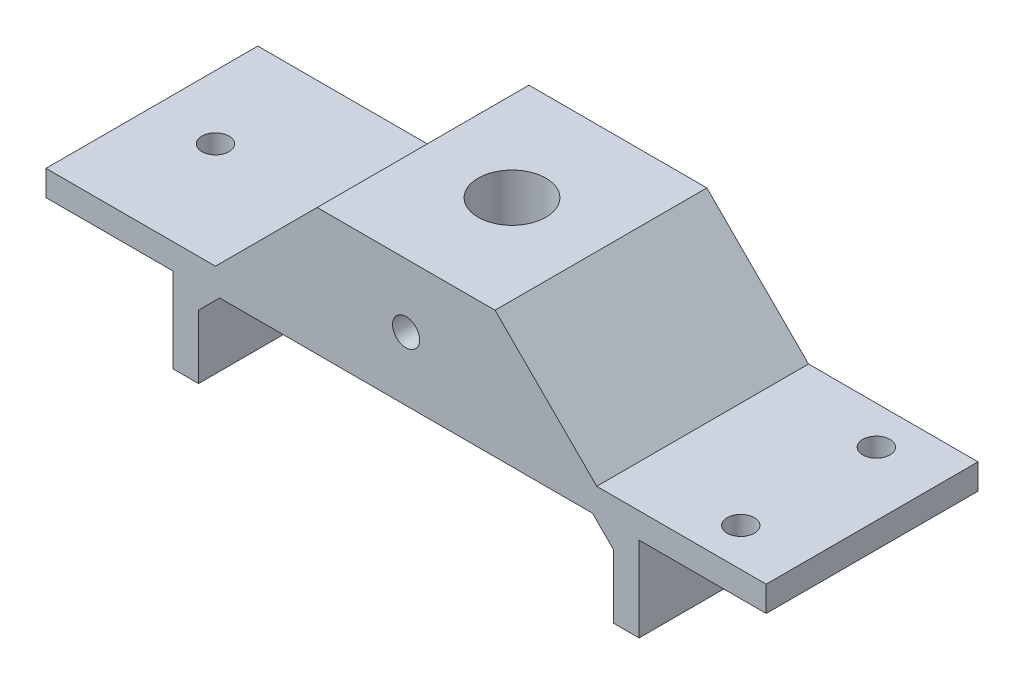
ISO-10303-21;
HEADER;
FILE_DESCRIPTION(('STEP AP214'),'2;1');
FILE_NAME('part.step','',(''),(''),'','','');
FILE_SCHEMA(('AUTOMOTIVE_DESIGN { 1 0 10303 214 1 1 1 1 }'));
ENDSEC;
DATA;
#1=APPLICATION_CONTEXT('core data for automotive mechanical design processes');
#2=APPLICATION_PROTOCOL_DEFINITION('international standard','automotive_design',2000,#1);
#3=PRODUCT_CONTEXT('',#1,'mechanical');
#4=PRODUCT('Part','Part','',(#3));
#5=PRODUCT_RELATED_PRODUCT_CATEGORY('part','',(#4));
#6=PRODUCT_DEFINITION_FORMATION('','',#4);
#7=PRODUCT_DEFINITION_CONTEXT('part definition',#1,'design');
#8=PRODUCT_DEFINITION('design','',#6,#7);
#9=PRODUCT_DEFINITION_SHAPE('','',#8);
#10=(LENGTH_UNIT() NAMED_UNIT(*) SI_UNIT(.MILLI.,.METRE.));
#11=(NAMED_UNIT(*) PLANE_ANGLE_UNIT() SI_UNIT($,.RADIAN.));
#12=(NAMED_UNIT(*) SI_UNIT($,.STERADIAN.) SOLID_ANGLE_UNIT());
#13=UNCERTAINTY_MEASURE_WITH_UNIT(LENGTH_MEASURE(1.E-05),#10,'distance_accuracy_value','');
#14=(GEOMETRIC_REPRESENTATION_CONTEXT(3) GLOBAL_UNCERTAINTY_ASSIGNED_CONTEXT((#13)) GLOBAL_UNIT_ASSIGNED_CONTEXT((#10,
#11,#12)) REPRESENTATION_CONTEXT('',''));
#15=CARTESIAN_POINT('',(0.,0.,0.));
#16=DIRECTION('',(0.,0.,1.));
#17=DIRECTION('',(1.,0.,0.));
#18=AXIS2_PLACEMENT_3D('',#15,#16,#17);
#19=CARTESIAN_POINT('',(-42.5,0.,25.));
#20=DIRECTION('',(0.,1.,0.));
#21=DIRECTION('',(0.,0.,1.));
#22=AXIS2_PLACEMENT_3D('',#19,#20,#21);
#23=PLANE('',#22);
#24=CARTESIAN_POINT('',(35.,0.,20.5));
#25=DIRECTION('',(0.,1.,0.));
#26=DIRECTION('',(0.,0.,1.));
#27=AXIS2_PLACEMENT_3D('',#24,#25,#26);
#28=CIRCLE('',#27,1.6);
#29=CARTESIAN_POINT('',(35.,0.,22.1));
#30=VERTEX_POINT('',#29);
#31=EDGE_CURVE('E516',#30,#30,#28,.F.);
#32=ORIENTED_EDGE('',*,*,#31,.T.);
#33=EDGE_LOOP('',(#32));
#34=FACE_BOUND('',#33,.T.);
#35=CARTESIAN_POINT('',(35.,0.,4.5));
#36=DIRECTION('',(0.,1.,0.));
#37=DIRECTION('',(0.,0.,1.));
#38=AXIS2_PLACEMENT_3D('',#35,#36,#37);
#39=CIRCLE('',#38,1.6);
#40=CARTESIAN_POINT('',(35.,0.,6.1));
#41=VERTEX_POINT('',#40);
#42=EDGE_CURVE('E510',#41,#41,#39,.F.);
#43=ORIENTED_EDGE('',*,*,#42,.T.);
#44=EDGE_LOOP('',(#43));
#45=FACE_BOUND('',#44,.T.);
#46=DIRECTION('',(1.,0.,0.));
#47=VECTOR('',#46,1.);
#48=CARTESIAN_POINT('',(-42.5,0.,0.));
#49=LINE('',#48,#47);
#50=CARTESIAN_POINT('',(22.5,0.,0.));
#51=VERTEX_POINT('',#50);
#52=CARTESIAN_POINT('',(42.5,0.,0.));
#53=VERTEX_POINT('',#52);
#54=EDGE_CURVE('E334',#51,#53,#49,.T.);
#55=ORIENTED_EDGE('',*,*,#54,.F.);
#56=DIRECTION('',(0.,0.,1.));
#57=VECTOR('',#56,1.);
#58=CARTESIAN_POINT('',(22.5,0.,25.));
#59=LINE('',#58,#57);
#60=CARTESIAN_POINT('',(22.5,0.,25.));
#61=VERTEX_POINT('',#60);
#62=EDGE_CURVE('E318',#51,#61,#59,.T.);
#63=ORIENTED_EDGE('',*,*,#62,.T.);
#64=DIRECTION('',(1.,0.,0.));
#65=VECTOR('',#64,1.);
#66=CARTESIAN_POINT('',(-42.5,0.,25.));
#67=LINE('',#66,#65);
#68=CARTESIAN_POINT('',(42.5,0.,25.));
#69=VERTEX_POINT('',#68);
#70=EDGE_CURVE('E342',#61,#69,#67,.T.);
#71=ORIENTED_EDGE('',*,*,#70,.T.);
#72=DIRECTION('',(0.,0.,-1.));
#73=VECTOR('',#72,1.);
#74=CARTESIAN_POINT('',(42.5,0.,25.));
#75=LINE('',#74,#73);
#76=EDGE_CURVE('E319',#69,#53,#75,.T.);
#77=ORIENTED_EDGE('',*,*,#76,.T.);
#78=EDGE_LOOP('',(#55,#63,#71,#77));
#79=FACE_BOUND('',#78,.T.);
#80=ADVANCED_FACE('F38',(#34,#45,#79),#23,.T.);
#81=CARTESIAN_POINT('',(-42.5,-3.,25.));
#82=DIRECTION('',(0.,1.,0.));
#83=DIRECTION('',(0.,0.,1.));
#84=AXIS2_PLACEMENT_3D('',#81,#82,#83);
#85=PLANE('',#84);
#86=CARTESIAN_POINT('',(0.,-3.,12.5));
#87=DIRECTION('',(0.,1.,0.));
#88=DIRECTION('',(0.,0.,1.));
#89=AXIS2_PLACEMENT_3D('',#86,#87,#88);
#90=CIRCLE('',#89,4.);
#91=CARTESIAN_POINT('',(0.,-3.,16.5));
#92=VERTEX_POINT('',#91);
#93=EDGE_CURVE('E198',#92,#92,#90,.F.);
#94=ORIENTED_EDGE('',*,*,#93,.F.);
#95=EDGE_LOOP('',(#94));
#96=FACE_BOUND('',#95,.T.);
#97=DIRECTION('',(1.,0.,0.));
#98=VECTOR('',#97,1.);
#99=CARTESIAN_POINT('',(-42.5,-3.,25.));
#100=LINE('',#99,#98);
#101=CARTESIAN_POINT('',(-22.,-3.,25.));
#102=VERTEX_POINT('',#101);
#103=CARTESIAN_POINT('',(22.,-3.,25.));
#104=VERTEX_POINT('',#103);
#105=EDGE_CURVE('E355',#102,#104,#100,.T.);
#106=ORIENTED_EDGE('',*,*,#105,.F.);
#107=DIRECTION('',(0.,0.,-1.));
#108=VECTOR('',#107,1.);
#109=CARTESIAN_POINT('',(-22.,-3.,0.));
#110=LINE('',#109,#108);
#111=CARTESIAN_POINT('',(-22.,-3.,0.));
#112=VERTEX_POINT('',#111);
#113=EDGE_CURVE('E67',#102,#112,#110,.T.);
#114=ORIENTED_EDGE('',*,*,#113,.T.);
#115=DIRECTION('',(1.,0.,0.));
#116=VECTOR('',#115,1.);
#117=CARTESIAN_POINT('',(-42.5,-3.,0.));
#118=LINE('',#117,#116);
#119=CARTESIAN_POINT('',(22.,-3.,0.));
#120=VERTEX_POINT('',#119);
#121=EDGE_CURVE('E295',#112,#120,#118,.T.);
#122=ORIENTED_EDGE('',*,*,#121,.T.);
#123=DIRECTION('',(0.,0.,1.));
#124=VECTOR('',#123,1.);
#125=CARTESIAN_POINT('',(22.,-3.,25.));
#126=LINE('',#125,#124);
#127=EDGE_CURVE('E452',#120,#104,#126,.T.);
#128=ORIENTED_EDGE('',*,*,#127,.T.);
#129=EDGE_LOOP('',(#106,#114,#122,#128));
#130=FACE_BOUND('',#129,.T.);
#131=ADVANCED_FACE('F405',(#96,#130),#85,.F.);
#132=CARTESIAN_POINT('',(35.,-3.,20.5));
#133=DIRECTION('',(0.,-1.,0.));
#134=DIRECTION('',(0.,0.,1.));
#135=AXIS2_PLACEMENT_3D('',#132,#133,#134);
#136=CIRCLE('',#135,1.6);
#137=CARTESIAN_POINT('',(35.,-3.,22.1));
#138=VERTEX_POINT('',#137);
#139=EDGE_CURVE('E512',#138,#138,#136,.T.);
#140=ORIENTED_EDGE('',*,*,#139,.F.);
#141=EDGE_LOOP('',(#140));
#142=FACE_BOUND('',#141,.T.);
#143=CARTESIAN_POINT('',(35.,-3.,4.5));
#144=DIRECTION('',(0.,-1.,0.));
#145=DIRECTION('',(0.,0.,-1.));
#146=AXIS2_PLACEMENT_3D('',#143,#144,#145);
#147=CIRCLE('',#146,1.6);
#148=CARTESIAN_POINT('',(35.,-3.,2.9));
#149=VERTEX_POINT('',#148);
#150=EDGE_CURVE('E191',#149,#149,#147,.T.);
#151=ORIENTED_EDGE('',*,*,#150,.F.);
#152=EDGE_LOOP('',(#151));
#153=FACE_BOUND('',#152,.T.);
#154=CARTESIAN_POINT('',(27.5,-3.,25.));
#155=VERTEX_POINT('',#154);
#156=CARTESIAN_POINT('',(42.5,-3.,25.));
#157=VERTEX_POINT('',#156);
#158=EDGE_CURVE('E296',#155,#157,#100,.T.);
#159=ORIENTED_EDGE('',*,*,#158,.F.);
#160=DIRECTION('',(0.,0.,-1.));
#161=VECTOR('',#160,1.);
#162=CARTESIAN_POINT('',(27.5,-3.,25.));
#163=LINE('',#162,#161);
#164=CARTESIAN_POINT('',(27.5,-3.,0.));
#165=VERTEX_POINT('',#164);
#166=EDGE_CURVE('E203',#155,#165,#163,.T.);
#167=ORIENTED_EDGE('',*,*,#166,.T.);
#168=CARTESIAN_POINT('',(42.5,-3.,0.));
#169=VERTEX_POINT('',#168);
#170=EDGE_CURVE('E289',#165,#169,#118,.T.);
#171=ORIENTED_EDGE('',*,*,#170,.T.);
#172=DIRECTION('',(0.,0.,-1.));
#173=VECTOR('',#172,1.);
#174=CARTESIAN_POINT('',(42.5,-3.,25.));
#175=LINE('',#174,#173);
#176=EDGE_CURVE('E314',#157,#169,#175,.T.);
#177=ORIENTED_EDGE('',*,*,#176,.F.);
#178=EDGE_LOOP('',(#159,#167,#171,#177));
#179=FACE_BOUND('',#178,.T.);
#180=ADVANCED_FACE('F412',(#142,#153,#179),#85,.F.);
#181=CARTESIAN_POINT('',(-35.,-3.,12.5));
#182=DIRECTION('',(0.,-1.,0.));
#183=DIRECTION('',(0.,0.,-1.));
#184=AXIS2_PLACEMENT_3D('',#181,#182,#183);
#185=CIRCLE('',#184,1.6);
#186=CARTESIAN_POINT('',(-35.,-3.,10.9));
#187=VERTEX_POINT('',#186);
#188=EDGE_CURVE('E502',#187,#187,#185,.T.);
#189=ORIENTED_EDGE('',*,*,#188,.F.);
#190=EDGE_LOOP('',(#189));
#191=FACE_BOUND('',#190,.T.);
#192=CARTESIAN_POINT('',(-42.5,-3.,0.));
#193=VERTEX_POINT('',#192);
#194=CARTESIAN_POINT('',(-27.5,-3.,0.));
#195=VERTEX_POINT('',#194);
#196=EDGE_CURVE('E310',#193,#195,#118,.T.);
#197=ORIENTED_EDGE('',*,*,#196,.T.);
#198=DIRECTION('',(0.,0.,1.));
#199=VECTOR('',#198,1.);
#200=CARTESIAN_POINT('',(-27.5,-3.,0.));
#201=LINE('',#200,#199);
#202=CARTESIAN_POINT('',(-27.5,-3.,25.));
#203=VERTEX_POINT('',#202);
#204=EDGE_CURVE('E243',#195,#203,#201,.T.);
#205=ORIENTED_EDGE('',*,*,#204,.T.);
#206=CARTESIAN_POINT('',(-42.5,-3.,25.));
#207=VERTEX_POINT('',#206);
#208=EDGE_CURVE('E269',#207,#203,#100,.T.);
#209=ORIENTED_EDGE('',*,*,#208,.F.);
#210=DIRECTION('',(0.,0.,-1.));
#211=VECTOR('',#210,1.);
#212=CARTESIAN_POINT('',(-42.5,-3.,25.));
#213=LINE('',#212,#211);
#214=EDGE_CURVE('E326',#207,#193,#213,.T.);
#215=ORIENTED_EDGE('',*,*,#214,.T.);
#216=EDGE_LOOP('',(#197,#205,#209,#215));
#217=FACE_BOUND('',#216,.T.);
#218=ADVANCED_FACE('F415',(#191,#217),#85,.F.);
#219=CARTESIAN_POINT('',(42.5,0.,25.));
#220=DIRECTION('',(1.,0.,0.));
#221=DIRECTION('',(0.,0.,-1.));
#222=AXIS2_PLACEMENT_3D('',#219,#220,#221);
#223=PLANE('',#222);
#224=DIRECTION('',(0.,-1.,0.));
#225=VECTOR('',#224,1.);
#226=CARTESIAN_POINT('',(42.5,0.,0.));
#227=LINE('',#226,#225);
#228=EDGE_CURVE('E303',#53,#169,#227,.T.);
#229=ORIENTED_EDGE('',*,*,#228,.F.);
#230=ORIENTED_EDGE('',*,*,#76,.F.);
#231=DIRECTION('',(0.,-1.,0.));
#232=VECTOR('',#231,1.);
#233=CARTESIAN_POINT('',(42.5,0.,25.));
#234=LINE('',#233,#232);
#235=EDGE_CURVE('E344',#69,#157,#234,.T.);
#236=ORIENTED_EDGE('',*,*,#235,.T.);
#237=ORIENTED_EDGE('',*,*,#176,.T.);
#238=EDGE_LOOP('',(#229,#230,#236,#237));
#239=FACE_BOUND('',#238,.T.);
#240=ADVANCED_FACE('F422',(#239),#223,.T.);
#241=CARTESIAN_POINT('',(-35.,0.,12.5));
#242=DIRECTION('',(0.,1.,0.));
#243=DIRECTION('',(0.,0.,1.));
#244=AXIS2_PLACEMENT_3D('',#241,#242,#243);
#245=CIRCLE('',#244,1.6);
#246=CARTESIAN_POINT('',(-35.,0.,14.1));
#247=VERTEX_POINT('',#246);
#248=EDGE_CURVE('E433',#247,#247,#245,.F.);
#249=ORIENTED_EDGE('',*,*,#248,.T.);
#250=EDGE_LOOP('',(#249));
#251=FACE_BOUND('',#250,.T.);
#252=CARTESIAN_POINT('',(-42.5,0.,25.));
#253=VERTEX_POINT('',#252);
#254=CARTESIAN_POINT('',(-22.4999999999999,0.,25.));
#255=VERTEX_POINT('',#254);
#256=EDGE_CURVE('E339',#253,#255,#67,.T.);
#257=ORIENTED_EDGE('',*,*,#256,.T.);
#258=DIRECTION('',(0.,0.,-1.));
#259=VECTOR('',#258,1.);
#260=CARTESIAN_POINT('',(-22.4999999999999,0.,25.));
#261=LINE('',#260,#259);
#262=CARTESIAN_POINT('',(-22.4999999999999,0.,0.));
#263=VERTEX_POINT('',#262);
#264=EDGE_CURVE('E435',#255,#263,#261,.T.);
#265=ORIENTED_EDGE('',*,*,#264,.T.);
#266=CARTESIAN_POINT('',(-42.5,0.,0.));
#267=VERTEX_POINT('',#266);
#268=EDGE_CURVE('E177',#267,#263,#49,.T.);
#269=ORIENTED_EDGE('',*,*,#268,.F.);
#270=DIRECTION('',(0.,0.,-1.));
#271=VECTOR('',#270,1.);
#272=CARTESIAN_POINT('',(-42.5,0.,25.));
#273=LINE('',#272,#271);
#274=EDGE_CURVE('E323',#253,#267,#273,.T.);
#275=ORIENTED_EDGE('',*,*,#274,.F.);
#276=EDGE_LOOP('',(#257,#265,#269,#275));
#277=FACE_BOUND('',#276,.T.);
#278=ADVANCED_FACE('F408',(#251,#277),#23,.T.);
#279=CARTESIAN_POINT('',(-42.5,-3.,25.));
#280=DIRECTION('',(-1.,0.,0.));
#281=DIRECTION('',(0.,0.,1.));
#282=AXIS2_PLACEMENT_3D('',#279,#280,#281);
#283=PLANE('',#282);
#284=DIRECTION('',(0.,1.,0.));
#285=VECTOR('',#284,1.);
#286=CARTESIAN_POINT('',(-42.5,-3.,0.));
#287=LINE('',#286,#285);
#288=EDGE_CURVE('E329',#193,#267,#287,.T.);
#289=ORIENTED_EDGE('',*,*,#288,.F.);
#290=ORIENTED_EDGE('',*,*,#214,.F.);
#291=DIRECTION('',(0.,1.,0.));
#292=VECTOR('',#291,1.);
#293=CARTESIAN_POINT('',(-42.5,-3.,25.));
#294=LINE('',#293,#292);
#295=EDGE_CURVE('E301',#207,#253,#294,.T.);
#296=ORIENTED_EDGE('',*,*,#295,.T.);
#297=ORIENTED_EDGE('',*,*,#274,.T.);
#298=EDGE_LOOP('',(#289,#290,#296,#297));
#299=FACE_BOUND('',#298,.T.);
#300=ADVANCED_FACE('F421',(#299),#283,.T.);
#301=CARTESIAN_POINT('',(0.,0.,25.));
#302=DIRECTION('',(0.,0.,-1.));
#303=DIRECTION('',(-1.,0.,0.));
#304=AXIS2_PLACEMENT_3D('',#301,#302,#303);
#305=PLANE('',#304);
#306=CARTESIAN_POINT('',(0.,4.5,25.));
#307=DIRECTION('',(0.,0.,1.));
#308=DIRECTION('',(1.,0.,0.));
#309=AXIS2_PLACEMENT_3D('',#306,#307,#308);
#310=CIRCLE('',#309,1.6);
#311=CARTESIAN_POINT('',(1.60000000000001,4.5,25.));
#312=VERTEX_POINT('',#311);
#313=EDGE_CURVE('E505',#312,#312,#310,.T.);
#314=ORIENTED_EDGE('',*,*,#313,.F.);
#315=EDGE_LOOP('',(#314));
#316=FACE_BOUND('',#315,.T.);
#317=DIRECTION('',(1.,0.,0.));
#318=VECTOR('',#317,1.);
#319=CARTESIAN_POINT('',(-12.5,12.,25.));
#320=LINE('',#319,#318);
#321=CARTESIAN_POINT('',(-10.5,12.,25.));
#322=VERTEX_POINT('',#321);
#323=CARTESIAN_POINT('',(10.5000000000001,12.,25.));
#324=VERTEX_POINT('',#323);
#325=EDGE_CURVE('E197',#322,#324,#320,.T.);
#326=ORIENTED_EDGE('',*,*,#325,.F.);
#327=DIRECTION('',(-0.707106781186544,-0.707106781186552,0.));
#328=VECTOR('',#327,1.);
#329=CARTESIAN_POINT('',(-11.2500000000001,11.25,25.));
#330=LINE('',#329,#328);
#331=EDGE_CURVE('E182',#322,#255,#330,.T.);
#332=ORIENTED_EDGE('',*,*,#331,.T.);
#333=ORIENTED_EDGE('',*,*,#256,.F.);
#334=ORIENTED_EDGE('',*,*,#295,.F.);
#335=ORIENTED_EDGE('',*,*,#208,.T.);
#336=DIRECTION('',(0.,1.,0.));
#337=VECTOR('',#336,1.);
#338=CARTESIAN_POINT('',(-27.5,-13.,25.));
#339=LINE('',#338,#337);
#340=CARTESIAN_POINT('',(-27.5,-13.,25.));
#341=VERTEX_POINT('',#340);
#342=EDGE_CURVE('E271',#341,#203,#339,.T.);
#343=ORIENTED_EDGE('',*,*,#342,.F.);
#344=DIRECTION('',(1.,0.,0.));
#345=VECTOR('',#344,1.);
#346=CARTESIAN_POINT('',(-27.5,-13.,25.));
#347=LINE('',#346,#345);
#348=CARTESIAN_POINT('',(-24.5,-13.,25.));
#349=VERTEX_POINT('',#348);
#350=EDGE_CURVE('E247',#341,#349,#347,.T.);
#351=ORIENTED_EDGE('',*,*,#350,.T.);
#352=DIRECTION('',(0.,1.,0.));
#353=VECTOR('',#352,1.);
#354=CARTESIAN_POINT('',(-24.5,-13.,25.));
#355=LINE('',#354,#353);
#356=CARTESIAN_POINT('',(-24.5,-5.50000000000002,25.));
#357=VERTEX_POINT('',#356);
#358=EDGE_CURVE('E274',#349,#357,#355,.T.);
#359=ORIENTED_EDGE('',*,*,#358,.T.);
#360=DIRECTION('',(-0.707106781186544,-0.707106781186551,0.));
#361=VECTOR('',#360,1.);
#362=CARTESIAN_POINT('',(-9.50000000000013,9.50000000000003,25.));
#363=LINE('',#362,#361);
#364=EDGE_CURVE('E53',#357,#102,#363,.F.);
#365=ORIENTED_EDGE('',*,*,#364,.T.);
#366=ORIENTED_EDGE('',*,*,#105,.T.);
#367=DIRECTION('',(-0.707106781186544,0.707106781186551,0.));
#368=VECTOR('',#367,1.);
#369=CARTESIAN_POINT('',(9.50000000000013,9.50000000000002,25.));
#370=LINE('',#369,#368);
#371=CARTESIAN_POINT('',(24.5,-5.50000000000002,25.));
#372=VERTEX_POINT('',#371);
#373=EDGE_CURVE('E459',#104,#372,#370,.F.);
#374=ORIENTED_EDGE('',*,*,#373,.T.);
#375=DIRECTION('',(0.,1.,0.));
#376=VECTOR('',#375,1.);
#377=CARTESIAN_POINT('',(24.5,-13.,25.));
#378=LINE('',#377,#376);
#379=CARTESIAN_POINT('',(24.5,-13.,25.));
#380=VERTEX_POINT('',#379);
#381=EDGE_CURVE('E225',#380,#372,#378,.T.);
#382=ORIENTED_EDGE('',*,*,#381,.F.);
#383=DIRECTION('',(1.,0.,0.));
#384=VECTOR('',#383,1.);
#385=CARTESIAN_POINT('',(24.5,-13.,25.));
#386=LINE('',#385,#384);
#387=CARTESIAN_POINT('',(27.5,-13.,25.));
#388=VERTEX_POINT('',#387);
#389=EDGE_CURVE('E221',#380,#388,#386,.T.);
#390=ORIENTED_EDGE('',*,*,#389,.T.);
#391=DIRECTION('',(0.,1.,0.));
#392=VECTOR('',#391,1.);
#393=CARTESIAN_POINT('',(27.5,-13.,25.));
#394=LINE('',#393,#392);
#395=EDGE_CURVE('E232',#388,#155,#394,.T.);
#396=ORIENTED_EDGE('',*,*,#395,.T.);
#397=ORIENTED_EDGE('',*,*,#158,.T.);
#398=ORIENTED_EDGE('',*,*,#235,.F.);
#399=ORIENTED_EDGE('',*,*,#70,.F.);
#400=DIRECTION('',(-0.707106781186544,0.707106781186551,0.));
#401=VECTOR('',#400,1.);
#402=CARTESIAN_POINT('',(11.2500000000001,11.25,25.));
#403=LINE('',#402,#401);
#404=EDGE_CURVE('E438',#61,#324,#403,.T.);
#405=ORIENTED_EDGE('',*,*,#404,.T.);
#406=EDGE_LOOP('',(#326,#332,#333,#334,#335,#343,#351,#359,#365,#366,#374,#382,#390,#396,#397,
#398,#399,#405));
#407=FACE_BOUND('',#406,.T.);
#408=ADVANCED_FACE('F428',(#316,#407),#305,.F.);
#409=CARTESIAN_POINT('',(0.,0.,0.));
#410=DIRECTION('',(0.,0.,-1.));
#411=DIRECTION('',(-1.,0.,0.));
#412=AXIS2_PLACEMENT_3D('',#409,#410,#411);
#413=PLANE('',#412);
#414=CARTESIAN_POINT('',(0.,4.5,0.));
#415=DIRECTION('',(0.,0.,-1.));
#416=DIRECTION('',(-1.,0.,0.));
#417=AXIS2_PLACEMENT_3D('',#414,#415,#416);
#418=CIRCLE('',#417,1.6);
#419=CARTESIAN_POINT('',(-1.59999999999999,4.5,0.));
#420=VERTEX_POINT('',#419);
#421=EDGE_CURVE('E374',#420,#420,#418,.F.);
#422=ORIENTED_EDGE('',*,*,#421,.T.);
#423=EDGE_LOOP('',(#422));
#424=FACE_BOUND('',#423,.T.);
#425=DIRECTION('',(0.707106781186544,0.707106781186552,0.));
#426=VECTOR('',#425,1.);
#427=CARTESIAN_POINT('',(-12.5,10.,0.));
#428=LINE('',#427,#426);
#429=CARTESIAN_POINT('',(-10.5,12.,0.));
#430=VERTEX_POINT('',#429);
#431=EDGE_CURVE('E170',#263,#430,#428,.T.);
#432=ORIENTED_EDGE('',*,*,#431,.T.);
#433=DIRECTION('',(-1.,0.,0.));
#434=VECTOR('',#433,1.);
#435=CARTESIAN_POINT('',(-12.5,12.,0.));
#436=LINE('',#435,#434);
#437=CARTESIAN_POINT('',(10.5000000000001,12.,0.));
#438=VERTEX_POINT('',#437);
#439=EDGE_CURVE('E174',#438,#430,#436,.T.);
#440=ORIENTED_EDGE('',*,*,#439,.F.);
#441=DIRECTION('',(0.707106781186544,-0.707106781186551,0.));
#442=VECTOR('',#441,1.);
#443=CARTESIAN_POINT('',(12.5,10.0000000000001,0.));
#444=LINE('',#443,#442);
#445=EDGE_CURVE('E445',#438,#51,#444,.T.);
#446=ORIENTED_EDGE('',*,*,#445,.T.);
#447=ORIENTED_EDGE('',*,*,#54,.T.);
#448=ORIENTED_EDGE('',*,*,#228,.T.);
#449=ORIENTED_EDGE('',*,*,#170,.F.);
#450=DIRECTION('',(0.,1.,0.));
#451=VECTOR('',#450,1.);
#452=CARTESIAN_POINT('',(27.5,-13.,0.));
#453=LINE('',#452,#451);
#454=CARTESIAN_POINT('',(27.5,-13.,0.));
#455=VERTEX_POINT('',#454);
#456=EDGE_CURVE('E235',#455,#165,#453,.T.);
#457=ORIENTED_EDGE('',*,*,#456,.F.);
#458=DIRECTION('',(-1.,0.,0.));
#459=VECTOR('',#458,1.);
#460=CARTESIAN_POINT('',(27.5,-13.,0.));
#461=LINE('',#460,#459);
#462=CARTESIAN_POINT('',(24.5,-13.,0.));
#463=VERTEX_POINT('',#462);
#464=EDGE_CURVE('E214',#455,#463,#461,.T.);
#465=ORIENTED_EDGE('',*,*,#464,.T.);
#466=DIRECTION('',(0.,1.,0.));
#467=VECTOR('',#466,1.);
#468=CARTESIAN_POINT('',(24.5,-13.,0.));
#469=LINE('',#468,#467);
#470=CARTESIAN_POINT('',(24.5,-5.50000000000002,0.));
#471=VERTEX_POINT('',#470);
#472=EDGE_CURVE('E239',#463,#471,#469,.T.);
#473=ORIENTED_EDGE('',*,*,#472,.T.);
#474=DIRECTION('',(0.707106781186544,-0.707106781186551,0.));
#475=VECTOR('',#474,1.);
#476=CARTESIAN_POINT('',(24.5,-5.50000000000002,0.));
#477=LINE('',#476,#475);
#478=EDGE_CURVE('E455',#471,#120,#477,.F.);
#479=ORIENTED_EDGE('',*,*,#478,.T.);
#480=ORIENTED_EDGE('',*,*,#121,.F.);
#481=DIRECTION('',(0.707106781186544,0.707106781186551,0.));
#482=VECTOR('',#481,1.);
#483=CARTESIAN_POINT('',(-24.5,-5.50000000000002,0.));
#484=LINE('',#483,#482);
#485=CARTESIAN_POINT('',(-24.5,-5.50000000000002,0.));
#486=VERTEX_POINT('',#485);
#487=EDGE_CURVE('E11',#112,#486,#484,.F.);
#488=ORIENTED_EDGE('',*,*,#487,.T.);
#489=DIRECTION('',(0.,1.,0.));
#490=VECTOR('',#489,1.);
#491=CARTESIAN_POINT('',(-24.5,-13.,0.));
#492=LINE('',#491,#490);
#493=CARTESIAN_POINT('',(-24.5,-13.,0.));
#494=VERTEX_POINT('',#493);
#495=EDGE_CURVE('E259',#494,#486,#492,.T.);
#496=ORIENTED_EDGE('',*,*,#495,.F.);
#497=DIRECTION('',(-1.,0.,0.));
#498=VECTOR('',#497,1.);
#499=CARTESIAN_POINT('',(-24.5,-13.,0.));
#500=LINE('',#499,#498);
#501=CARTESIAN_POINT('',(-27.5,-13.,0.));
#502=VERTEX_POINT('',#501);
#503=EDGE_CURVE('E255',#494,#502,#500,.T.);
#504=ORIENTED_EDGE('',*,*,#503,.T.);
#505=DIRECTION('',(0.,1.,0.));
#506=VECTOR('',#505,1.);
#507=CARTESIAN_POINT('',(-27.5,-13.,0.));
#508=LINE('',#507,#506);
#509=EDGE_CURVE('E275',#502,#195,#508,.T.);
#510=ORIENTED_EDGE('',*,*,#509,.T.);
#511=ORIENTED_EDGE('',*,*,#196,.F.);
#512=ORIENTED_EDGE('',*,*,#288,.T.);
#513=ORIENTED_EDGE('',*,*,#268,.T.);
#514=EDGE_LOOP('',(#432,#440,#446,#447,#448,#449,#457,#465,#473,#479,#480,#488,#496,#504,#510,
#511,#512,#513));
#515=FACE_BOUND('',#514,.T.);
#516=ADVANCED_FACE('F172',(#424,#515),#413,.T.);
#517=CARTESIAN_POINT('',(-24.5,-13.,0.));
#518=DIRECTION('',(-1.,0.,0.));
#519=DIRECTION('',(0.,0.,1.));
#520=AXIS2_PLACEMENT_3D('',#517,#518,#519);
#521=PLANE('',#520);
#522=ORIENTED_EDGE('',*,*,#495,.T.);
#523=DIRECTION('',(0.,0.,1.));
#524=VECTOR('',#523,1.);
#525=CARTESIAN_POINT('',(-24.5,-5.50000000000002,25.));
#526=LINE('',#525,#524);
#527=EDGE_CURVE('E366',#486,#357,#526,.T.);
#528=ORIENTED_EDGE('',*,*,#527,.T.);
#529=ORIENTED_EDGE('',*,*,#358,.F.);
#530=DIRECTION('',(0.,0.,1.));
#531=VECTOR('',#530,1.);
#532=CARTESIAN_POINT('',(-24.5,-13.,0.));
#533=LINE('',#532,#531);
#534=EDGE_CURVE('E244',#494,#349,#533,.T.);
#535=ORIENTED_EDGE('',*,*,#534,.F.);
#536=EDGE_LOOP('',(#522,#528,#529,#535));
#537=FACE_BOUND('',#536,.T.);
#538=ADVANCED_FACE('F466',(#537),#521,.F.);
#539=CARTESIAN_POINT('',(-27.5,-13.,0.));
#540=DIRECTION('',(-1.,0.,0.));
#541=DIRECTION('',(0.,0.,1.));
#542=AXIS2_PLACEMENT_3D('',#539,#540,#541);
#543=PLANE('',#542);
#544=ORIENTED_EDGE('',*,*,#204,.F.);
#545=ORIENTED_EDGE('',*,*,#509,.F.);
#546=DIRECTION('',(0.,0.,1.));
#547=VECTOR('',#546,1.);
#548=CARTESIAN_POINT('',(-27.5,-13.,0.));
#549=LINE('',#548,#547);
#550=EDGE_CURVE('E251',#502,#341,#549,.T.);
#551=ORIENTED_EDGE('',*,*,#550,.T.);
#552=ORIENTED_EDGE('',*,*,#342,.T.);
#553=EDGE_LOOP('',(#544,#545,#551,#552));
#554=FACE_BOUND('',#553,.T.);
#555=ADVANCED_FACE('F477',(#554),#543,.T.);
#556=CARTESIAN_POINT('',(0.,-13.,0.));
#557=DIRECTION('',(0.,1.,0.));
#558=DIRECTION('',(-1.,0.,0.));
#559=AXIS2_PLACEMENT_3D('',#556,#557,#558);
#560=PLANE('',#559);
#561=ORIENTED_EDGE('',*,*,#534,.T.);
#562=ORIENTED_EDGE('',*,*,#350,.F.);
#563=ORIENTED_EDGE('',*,*,#550,.F.);
#564=ORIENTED_EDGE('',*,*,#503,.F.);
#565=EDGE_LOOP('',(#561,#562,#563,#564));
#566=FACE_BOUND('',#565,.T.);
#567=ADVANCED_FACE('F473',(#566),#560,.F.);
#568=CARTESIAN_POINT('',(24.5,-13.,25.));
#569=DIRECTION('',(1.,0.,0.));
#570=DIRECTION('',(0.,0.,-1.));
#571=AXIS2_PLACEMENT_3D('',#568,#569,#570);
#572=PLANE('',#571);
#573=ORIENTED_EDGE('',*,*,#381,.T.);
#574=DIRECTION('',(0.,0.,-1.));
#575=VECTOR('',#574,1.);
#576=CARTESIAN_POINT('',(24.5,-5.50000000000002,0.));
#577=LINE('',#576,#575);
#578=EDGE_CURVE('E181',#372,#471,#577,.T.);
#579=ORIENTED_EDGE('',*,*,#578,.T.);
#580=ORIENTED_EDGE('',*,*,#472,.F.);
#581=DIRECTION('',(0.,0.,1.));
#582=VECTOR('',#581,1.);
#583=CARTESIAN_POINT('',(24.5,-13.,25.));
#584=LINE('',#583,#582);
#585=EDGE_CURVE('E211',#380,#463,#584,.F.);
#586=ORIENTED_EDGE('',*,*,#585,.F.);
#587=EDGE_LOOP('',(#573,#579,#580,#586));
#588=FACE_BOUND('',#587,.T.);
#589=ADVANCED_FACE('F545',(#588),#572,.F.);
#590=CARTESIAN_POINT('',(27.5,-13.,25.));
#591=DIRECTION('',(1.,0.,0.));
#592=DIRECTION('',(0.,0.,-1.));
#593=AXIS2_PLACEMENT_3D('',#590,#591,#592);
#594=PLANE('',#593);
#595=ORIENTED_EDGE('',*,*,#166,.F.);
#596=ORIENTED_EDGE('',*,*,#395,.F.);
#597=DIRECTION('',(0.,0.,-1.));
#598=VECTOR('',#597,1.);
#599=CARTESIAN_POINT('',(27.5,-13.,25.));
#600=LINE('',#599,#598);
#601=EDGE_CURVE('E218',#388,#455,#600,.T.);
#602=ORIENTED_EDGE('',*,*,#601,.T.);
#603=ORIENTED_EDGE('',*,*,#456,.T.);
#604=EDGE_LOOP('',(#595,#596,#602,#603));
#605=FACE_BOUND('',#604,.T.);
#606=ADVANCED_FACE('F539',(#605),#594,.T.);
#607=CARTESIAN_POINT('',(0.,-13.,0.));
#608=DIRECTION('',(0.,-1.,0.));
#609=DIRECTION('',(1.,0.,0.));
#610=AXIS2_PLACEMENT_3D('',#607,#608,#609);
#611=PLANE('',#610);
#612=ORIENTED_EDGE('',*,*,#585,.T.);
#613=ORIENTED_EDGE('',*,*,#464,.F.);
#614=ORIENTED_EDGE('',*,*,#601,.F.);
#615=ORIENTED_EDGE('',*,*,#389,.F.);
#616=EDGE_LOOP('',(#612,#613,#614,#615));
#617=FACE_BOUND('',#616,.T.);
#618=ADVANCED_FACE('F533',(#617),#611,.T.);
#619=CARTESIAN_POINT('',(0.,12.,0.));
#620=DIRECTION('',(0.,-1.,0.));
#621=DIRECTION('',(0.,0.,-1.));
#622=AXIS2_PLACEMENT_3D('',#619,#620,#621);
#623=PLANE('',#622);
#624=CARTESIAN_POINT('',(0.,12.,12.5));
#625=DIRECTION('',(0.,1.,0.));
#626=DIRECTION('',(0.,0.,1.));
#627=AXIS2_PLACEMENT_3D('',#624,#625,#626);
#628=CIRCLE('',#627,4.);
#629=CARTESIAN_POINT('',(0.,12.,16.5));
#630=VERTEX_POINT('',#629);
#631=EDGE_CURVE('E207',#630,#630,#628,.T.);
#632=ORIENTED_EDGE('',*,*,#631,.F.);
#633=EDGE_LOOP('',(#632));
#634=FACE_BOUND('',#633,.T.);
#635=ORIENTED_EDGE('',*,*,#439,.T.);
#636=DIRECTION('',(0.,0.,-1.));
#637=VECTOR('',#636,1.);
#638=CARTESIAN_POINT('',(-10.5,12.,25.00105));
#639=LINE('',#638,#637);
#640=EDGE_CURVE('E185',#322,#430,#639,.T.);
#641=ORIENTED_EDGE('',*,*,#640,.F.);
#642=ORIENTED_EDGE('',*,*,#325,.T.);
#643=DIRECTION('',(0.,0.,-1.));
#644=VECTOR('',#643,1.);
#645=CARTESIAN_POINT('',(10.5000000000001,12.,25.00105));
#646=LINE('',#645,#644);
#647=EDGE_CURVE('E190',#324,#438,#646,.T.);
#648=ORIENTED_EDGE('',*,*,#647,.T.);
#649=EDGE_LOOP('',(#635,#641,#642,#648));
#650=FACE_BOUND('',#649,.T.);
#651=ADVANCED_FACE('F194',(#634,#650),#623,.F.);
#652=CARTESIAN_POINT('',(0.,-13.001025,12.5));
#653=DIRECTION('',(0.,1.,0.));
#654=DIRECTION('',(0.,0.,1.));
#655=AXIS2_PLACEMENT_3D('',#652,#653,#654);
#656=CYLINDRICAL_SURFACE('',#655,4.);
#657=CARTESIAN_POINT('',(0.,2.9,16.5));
#658=CARTESIAN_POINT('',(0.0859944043543153,2.90000788145899,16.4999941698167));
#659=CARTESIAN_POINT('',(0.172138051272541,2.9069742016707,16.4971943544555));
#660=CARTESIAN_POINT('',(0.34199718433432,2.93459816281699,16.4862676248051));
#661=CARTESIAN_POINT('',(0.425705422049001,2.95529302326891,16.478126229591));
#662=CARTESIAN_POINT('',(0.587963138181925,3.00950086244706,16.4573936737049));
#663=CARTESIAN_POINT('',(0.666528529293569,3.04297187697338,16.4448170909126));
#664=CARTESIAN_POINT('',(0.816857576262697,3.12161533866123,16.4164528863686));
#665=CARTESIAN_POINT('',(0.888623581400797,3.16678372393514,16.4006663796645));
#666=CARTESIAN_POINT('',(1.02680080605632,3.26978839884875,16.3666470893633));
#667=CARTESIAN_POINT('',(1.09284981804017,3.32808532499221,16.3483383754335));
#668=CARTESIAN_POINT('',(1.21454000382778,3.45472000278142,16.3116846152496));
#669=CARTESIAN_POINT('',(1.27017608570683,3.52306263776939,16.2933395556303));
#670=CARTESIAN_POINT('',(1.37189965383431,3.67154245619381,16.2577823343771));
#671=CARTESIAN_POINT('',(1.41745198495638,3.75206918881855,16.2406569277196));
#672=CARTESIAN_POINT('',(1.49420377522972,3.92042911873603,16.2106691774943));
#673=CARTESIAN_POINT('',(1.52541005142867,4.00825882227868,16.1978048099534));
#674=CARTESIAN_POINT('',(1.5711190587167,4.18456986687368,16.1786108612865));
#675=CARTESIAN_POINT('',(1.58631517264453,4.27284098846097,16.1720113628448));
#676=CARTESIAN_POINT('',(1.60173836931203,4.45090799864581,16.1653120323931));
#677=CARTESIAN_POINT('',(1.60197281305059,4.54070311570001,16.1652090041821));
#678=CARTESIAN_POINT('',(1.58799149400364,4.71260533716643,16.1712840022399));
#679=CARTESIAN_POINT('',(1.57478025144412,4.79481257152722,16.1770254003076));
#680=CARTESIAN_POINT('',(1.53595750423826,4.95572764480537,16.1934095008627));
#681=CARTESIAN_POINT('',(1.51034383584371,5.03443487048824,16.2040530585734));
#682=CARTESIAN_POINT('',(1.44695578604087,5.18801426895683,16.2292758807082));
#683=CARTESIAN_POINT('',(1.40894388985226,5.26277539124375,16.2439310342463));
#684=CARTESIAN_POINT('',(1.32200516858578,5.40513265308925,16.2755049311191));
#685=CARTESIAN_POINT('',(1.27307424408069,5.47272608752224,16.2924245236548));
#686=CARTESIAN_POINT('',(1.16124047956356,5.60432778304159,16.3282138939382));
#687=CARTESIAN_POINT('',(1.09754997037652,5.66765498355681,16.3471333198092));
#688=CARTESIAN_POINT('',(0.960251541944168,5.78294758240163,16.3836785996663));
#689=CARTESIAN_POINT('',(0.886641652267561,5.83491071792823,16.4013041955626));
#690=CARTESIAN_POINT('',(0.729662122084689,5.92689395793266,16.4337174501164));
#691=CARTESIAN_POINT('',(0.646128393077196,5.96665782495764,16.4484421607633));
#692=CARTESIAN_POINT('',(0.47281901238632,6.03133428886244,16.4729186266301));
#693=CARTESIAN_POINT('',(0.383046557479754,6.05625443004593,16.4826729076991));
#694=CARTESIAN_POINT('',(0.20551671008627,6.08915863633576,16.4956491160553));
#695=CARTESIAN_POINT('',(0.117954635188442,6.09805796340285,16.4992235666681));
#696=CARTESIAN_POINT('',(-0.05747624784624,6.10137048042289,16.500547828085));
#697=CARTESIAN_POINT('',(-0.145344970579125,6.09578742523801,16.4982991486583));
#698=CARTESIAN_POINT('',(-0.314746191297577,6.07096659795841,16.48846053651));
#699=CARTESIAN_POINT('',(-0.396385993420367,6.05235361571922,16.4811151307642));
#700=CARTESIAN_POINT('',(-0.555308342448612,6.00285143335215,16.462075531244));
#701=CARTESIAN_POINT('',(-0.632590328179863,5.97196065626506,16.4503807788522));
#702=CARTESIAN_POINT('',(-0.78326302865335,5.89777204825604,16.4233327581665));
#703=CARTESIAN_POINT('',(-0.856462418204313,5.85412362236549,16.4078785278384));
#704=CARTESIAN_POINT('',(-0.994754872997233,5.75604774087549,16.3749869179642));
#705=CARTESIAN_POINT('',(-1.05984467260889,5.70161596566191,16.3575487448822));
#706=CARTESIAN_POINT('',(-1.18457843442304,5.5793039896403,16.3211609411049));
#707=CARTESIAN_POINT('',(-1.24357914704484,5.51077316679504,16.3021875314004));
#708=CARTESIAN_POINT('',(-1.34940095793096,5.36444793359251,16.2659333833371));
#709=CARTESIAN_POINT('',(-1.39622004907,5.28665199972805,16.2486529242121));
#710=CARTESIAN_POINT('',(-1.47664600154529,5.12283064432472,16.2177143992617));
#711=CARTESIAN_POINT('',(-1.51012047562755,5.03673280063016,16.2040930470783));
#712=CARTESIAN_POINT('',(-1.56183697576423,4.85941307862788,16.1825893878235));
#713=CARTESIAN_POINT('',(-1.58009024421544,4.76819503535007,16.174702845568));
#714=CARTESIAN_POINT('',(-1.59977249382271,4.59029767858037,16.1661740743994));
#715=CARTESIAN_POINT('',(-1.60231766584229,4.50376412832532,16.1650513680654));
#716=CARTESIAN_POINT('',(-1.59344252742201,4.33156411382937,16.1689186882648));
#717=CARTESIAN_POINT('',(-1.58202399033102,4.24589754087794,16.1739079385983));
#718=CARTESIAN_POINT('',(-1.54645709292291,4.08133424811597,16.1890131926322));
#719=CARTESIAN_POINT('',(-1.52282999485678,4.00230378045361,16.1989186546196));
#720=CARTESIAN_POINT('',(-1.4640043587928,3.84929709630922,16.2225920098616));
#721=CARTESIAN_POINT('',(-1.42880262511505,3.77532228248015,16.2363609696481));
#722=CARTESIAN_POINT('',(-1.34549821020778,3.62991230458338,16.2671888768359));
#723=CARTESIAN_POINT('',(-1.29677226812759,3.55886506389562,16.2843910585059));
#724=CARTESIAN_POINT('',(-1.18871369541719,3.425605346237,16.3197104349779));
#725=CARTESIAN_POINT('',(-1.12937786785449,3.36339554229735,16.3378279043872));
#726=CARTESIAN_POINT('',(-0.997204405017968,3.24543771738911,16.3743485366991));
#727=CARTESIAN_POINT('',(-0.923740800916909,3.19037015448155,16.3926940636975));
#728=CARTESIAN_POINT('',(-0.767920256228622,3.0933303659027,16.4264032537097));
#729=CARTESIAN_POINT('',(-0.685559203637789,3.05136423027798,16.4417655287432));
#730=CARTESIAN_POINT('',(-0.515790449996161,2.98270222784777,16.4675177185269));
#731=CARTESIAN_POINT('',(-0.428505294575755,2.95573654115173,16.4779949044402));
#732=CARTESIAN_POINT('',(-0.250301237024975,2.91708870323659,16.4931544496749));
#733=CARTESIAN_POINT('',(-0.159394820687129,2.90535805060488,16.4978551959651));
#734=CARTESIAN_POINT('',(-0.0455298383127427,2.90048369521738,16.4998071960331));
#735=CARTESIAN_POINT('',(-0.0227701509926053,2.89999791309665,16.5000015437534));
#736=CARTESIAN_POINT('',(0.,2.9,16.5));
#737=B_SPLINE_CURVE_WITH_KNOTS('',3,(#657,#658,#659,#660,#661,#662,#663,#664,#665,#666,#667,
#668,#669,#670,#671,#672,#673,#674,#675,#676,#677,#678,#679,#680,#681,#682,#683,#684,#685,#686,
#687,#688,#689,#690,#691,#692,#693,#694,#695,#696,#697,#698,#699,#700,#701,#702,#703,#704,#705,
#706,#707,#708,#709,#710,#711,#712,#713,#714,#715,#716,#717,#718,#719,#720,#721,#722,#723,#724,
#725,#726,#727,#728,#729,#730,#731,#732,#733,#734,#735,#736),.UNSPECIFIED.,.T.,.F.,(4,2,2,2,2,2,
2,2,2,2,2,2,2,2,2,2,2,2,2,2,2,2,2,2,2,2,2,2,2,2,2,2,2,2,2,2,2,2,2,4),(0.,0.257922390314458,
0.516546908806348,0.774329165977264,1.03202202854387,1.30077905360318,1.56966715947529,
1.85052207055374,2.13124338494614,2.39923284247063,2.66709045072391,2.91630662721098,
3.16556629804838,3.41991301039053,3.67435537550546,3.94846679349245,4.22263274271786,
4.50221530530245,4.78165564891032,5.04455347622406,5.30738314856066,5.55840364451493,
5.80945639195037,6.0681881071861,6.32702367599175,6.60294779699531,6.87891735234999,
7.15756036112662,7.43599738116747,7.69439738714198,7.95276458050436,8.20091454839015,
8.44913308644129,8.71156374445354,8.97407361078715,9.25360338827069,9.53326290912426,
9.80771440810655,10.0812900192347,10.1495843671744),.UNSPECIFIED.);
#738=CARTESIAN_POINT('',(0.,2.9,16.5));
#739=VERTEX_POINT('',#738);
#740=EDGE_CURVE('E42',#739,#739,#737,.T.);
#741=ORIENTED_EDGE('',*,*,#740,.T.);
#742=EDGE_LOOP('',(#741));
#743=FACE_BOUND('',#742,.T.);
#744=CARTESIAN_POINT('',(1.60000000000001,4.5,8.83393944403532));
#745=CARTESIAN_POINT('',(1.59999060336304,4.41428840152009,8.83393078674862));
#746=CARTESIAN_POINT('',(1.59307185487549,4.32845557223624,8.83089118012588));
#747=CARTESIAN_POINT('',(1.56565522447419,4.15925213369835,8.81911268649724));
#748=CARTESIAN_POINT('',(1.54512264355371,4.07588838633561,8.81035923690519));
#749=CARTESIAN_POINT('',(1.49138802605497,3.91435764642396,8.78831635366963));
#750=CARTESIAN_POINT('',(1.45823372202035,3.8361723621118,8.77504402914308));
#751=CARTESIAN_POINT('',(1.3803362154973,3.68649195931231,8.74548267923775));
#752=CARTESIAN_POINT('',(1.33559554341401,3.61499538467931,8.72919431276861));
#753=CARTESIAN_POINT('',(1.23305757966994,3.47659167820684,8.69439307959173));
#754=CARTESIAN_POINT('',(1.17470348618187,3.41011486165642,8.67580865633003));
#755=CARTESIAN_POINT('',(1.04776728461924,3.2875768021477,8.63910034416951));
#756=CARTESIAN_POINT('',(0.979181617340552,3.23151919896811,8.62097661810902));
#757=CARTESIAN_POINT('',(0.83040504828511,3.12927488241384,8.58637273674516));
#758=CARTESIAN_POINT('',(0.749863172489832,3.08356455882348,8.56998557053145));
#759=CARTESIAN_POINT('',(0.581460258300104,3.00652514528815,8.54156857894762));
#760=CARTESIAN_POINT('',(0.493602215430377,2.97519020337444,8.5295369809226));
#761=CARTESIAN_POINT('',(0.317573141471121,2.92932681085008,8.51169339993372));
#762=CARTESIAN_POINT('',(0.229623187843692,2.91405814872879,8.50560850579714));
#763=CARTESIAN_POINT('',(0.052213062910128,2.89837721146985,8.49935751453837));
#764=CARTESIAN_POINT('',(-0.0372465326603152,2.89795939525212,8.49918920984549));
#765=CARTESIAN_POINT('',(-0.209785995772242,2.91158621581999,8.50462429742571));
#766=CARTESIAN_POINT('',(-0.292941962299219,2.92481981819755,8.50990402582531));
#767=CARTESIAN_POINT('',(-0.455738487374663,2.96399430104861,8.52520566824967));
#768=CARTESIAN_POINT('',(-0.535378787512119,2.98993611392031,8.53522793023109));
#769=CARTESIAN_POINT('',(-0.690318350809317,3.05410918630104,8.5592254043384));
#770=CARTESIAN_POINT('',(-0.765534098703699,3.09251977185243,8.57325791626559));
#771=CARTESIAN_POINT('',(-0.908646520592452,3.18037200553521,8.60388331856241));
#772=CARTESIAN_POINT('',(-0.976540674172879,3.2298174344781,8.6204770858794));
#773=CARTESIAN_POINT('',(-1.10781506239371,3.34211930875728,8.65582690257332));
#774=CARTESIAN_POINT('',(-1.17060627621891,3.40564311406707,8.67465338783807));
#775=CARTESIAN_POINT('',(-1.28488593230825,3.54239245745677,8.71150671228176));
#776=CARTESIAN_POINT('',(-1.33637067500772,3.61562115852333,8.72953328818922));
#777=CARTESIAN_POINT('',(-1.42792335099434,3.77233521792716,8.7632248204655));
#778=CARTESIAN_POINT('',(-1.46762772138792,3.85605186438705,8.77880868654895));
#779=CARTESIAN_POINT('',(-1.532141007973,4.02977239236961,8.8048992762614));
#780=CARTESIAN_POINT('',(-1.55695959872351,4.11977214781668,8.81540929661328));
#781=CARTESIAN_POINT('',(-1.58956395906556,4.29762862194884,8.82936192261948));
#782=CARTESIAN_POINT('',(-1.59829767744672,4.38528035769613,8.83319706841539));
#783=CARTESIAN_POINT('',(-1.60124906115921,4.56086176621436,8.83448401698321));
#784=CARTESIAN_POINT('',(-1.5954711284743,4.64879134662227,8.83193775550029));
#785=CARTESIAN_POINT('',(-1.57042631583081,4.81716714796391,8.82115164514294));
#786=CARTESIAN_POINT('',(-1.55194644961876,4.89775434991961,8.81324433761784));
#787=CARTESIAN_POINT('',(-1.50304334952901,5.05463072382881,8.79303959177702));
#788=CARTESIAN_POINT('',(-1.47261746744191,5.13091893848585,8.78074118009005));
#789=CARTESIAN_POINT('',(-1.39930851158515,5.28048188623639,8.75252974512039));
#790=CARTESIAN_POINT('',(-1.35597029461167,5.35350895095557,8.73649036288691));
#791=CARTESIAN_POINT('',(-1.25853217955349,5.49158638995333,8.70279691873729));
#792=CARTESIAN_POINT('',(-1.20442789878558,5.55663349823648,8.68514220083149));
#793=CARTESIAN_POINT('',(-1.08227536934438,5.68189872687937,8.64863267222882));
#794=CARTESIAN_POINT('',(-1.01349234355607,5.74140525223283,8.62978554171838));
#795=CARTESIAN_POINT('',(-0.866466906695065,5.84814166128827,8.59424164345949));
#796=CARTESIAN_POINT('',(-0.788224110774281,5.89537104527779,8.57754496325408));
#797=CARTESIAN_POINT('',(-0.624223947201399,5.97603810116898,8.54813027279771));
#798=CARTESIAN_POINT('',(-0.538468384795243,6.00947907533263,8.5354113100778));
#799=CARTESIAN_POINT('',(-0.36191487273537,6.06123908192611,8.51541829224567));
#800=CARTESIAN_POINT('',(-0.271119688235405,6.07956632115205,8.50814128233965));
#801=CARTESIAN_POINT('',(-0.0934532082770324,6.09960376130031,8.5001679343159));
#802=CARTESIAN_POINT('',(-0.00671239407443446,6.10232010277012,8.49907322604101));
#803=CARTESIAN_POINT('',(0.165947068586604,6.09371561657272,8.50251166097125));
#804=CARTESIAN_POINT('',(0.251865839515707,6.0823969137715,8.5070439522647));
#805=CARTESIAN_POINT('',(0.417736721557137,6.04676256931322,8.52102789308596));
#806=CARTESIAN_POINT('',(0.497791043718717,6.02285684313955,8.53032415492535));
#807=CARTESIAN_POINT('',(0.65273788380716,5.96315775635054,8.5528404173437));
#808=CARTESIAN_POINT('',(0.727629446613829,5.92736220318372,8.5660611415679));
#809=CARTESIAN_POINT('',(0.8737624334849,5.84311744120853,8.59585524511953));
#810=CARTESIAN_POINT('',(0.944696309445148,5.79417896409193,8.61255096217416));
#811=CARTESIAN_POINT('',(1.07764322281927,5.68576918465685,8.64728477450842));
#812=CARTESIAN_POINT('',(1.13965254859661,5.62629352283191,8.66532342359599));
#813=CARTESIAN_POINT('',(1.2569610120688,5.49414782037996,8.70209789152462));
#814=CARTESIAN_POINT('',(1.31160710975923,5.42088890127912,8.72080773915693));
#815=CARTESIAN_POINT('',(1.40787796035153,5.26564629005698,8.75560262819856));
#816=CARTESIAN_POINT('',(1.44950118232,5.18366157367211,8.77168736090035));
#817=CARTESIAN_POINT('',(1.51519287013866,5.02077023852154,8.79792908433673));
#818=CARTESIAN_POINT('',(1.54050201133137,4.94042781219906,8.80848865110681));
#819=CARTESIAN_POINT('',(1.57817420625472,4.77641166429573,8.82443197116829));
#820=CARTESIAN_POINT('',(1.59057333431042,4.69274790722643,8.8298301434226));
#821=CARTESIAN_POINT('',(1.59877140664815,4.57249795012966,8.83340432993892));
#822=CARTESIAN_POINT('',(1.60000397519591,4.53625982320192,8.83394310645314));
#823=CARTESIAN_POINT('',(1.60000000000001,4.5,8.83393944403532));
#824=B_SPLINE_CURVE_WITH_KNOTS('',3,(#744,#745,#746,#747,#748,#749,#750,#751,#752,#753,#754,
#755,#756,#757,#758,#759,#760,#761,#762,#763,#764,#765,#766,#767,#768,#769,#770,#771,#772,#773,
#774,#775,#776,#777,#778,#779,#780,#781,#782,#783,#784,#785,#786,#787,#788,#789,#790,#791,#792,
#793,#794,#795,#796,#797,#798,#799,#800,#801,#802,#803,#804,#805,#806,#807,#808,#809,#810,#811,
#812,#813,#814,#815,#816,#817,#818,#819,#820,#821,#822,#823),.UNSPECIFIED.,.T.,.F.,(4,2,2,2,2,2,
2,2,2,2,2,2,2,2,2,2,2,2,2,2,2,2,2,2,2,2,2,2,2,2,2,2,2,2,2,2,2,2,2,4),(0.,0.257022119014123,
0.514701868657797,0.771416658634714,1.02807543059089,1.2980449462754,1.56810859478674,
1.84882135273143,2.12941973575584,2.39643346309747,2.66334756244538,2.91526915864242,
3.16720924103248,3.42294640187919,3.67877131952025,3.95139235265084,4.22410245701701,
4.50451566971661,4.78474643835289,5.04785718014744,5.3108881192156,5.55893798463324,
5.80704286916518,6.06520923717369,6.32348091615887,6.60082987392792,6.87819011877406,
7.15548389845458,7.43262700758517,7.6916883179997,7.95071041205289,8.2017759554989,
8.45288782258076,8.71509640907148,8.97741373246573,9.25597002623699,9.53455905402559,
9.78813328650469,10.040997041706,10.1497288441659),.UNSPECIFIED.);
#825=CARTESIAN_POINT('',(1.60000000000001,4.5,8.83393944403532));
#826=VERTEX_POINT('',#825);
#827=EDGE_CURVE('E368',#826,#826,#824,.T.);
#828=ORIENTED_EDGE('',*,*,#827,.T.);
#829=EDGE_LOOP('',(#828));
#830=FACE_BOUND('',#829,.T.);
#831=ORIENTED_EDGE('',*,*,#631,.T.);
#832=EDGE_LOOP('',(#831));
#833=FACE_BOUND('',#832,.T.);
#834=ORIENTED_EDGE('',*,*,#93,.T.);
#835=EDGE_LOOP('',(#834));
#836=FACE_BOUND('',#835,.T.);
#837=ADVANCED_FACE('F375',(#743,#830,#833,#836),#656,.F.);
#838=CARTESIAN_POINT('',(12.5,10.0000000000001,25.));
#839=DIRECTION('',(-0.707106781186551,-0.707106781186544,0.));
#840=DIRECTION('',(0.,0.,-1.));
#841=AXIS2_PLACEMENT_3D('',#838,#839,#840);
#842=PLANE('',#841);
#843=ORIENTED_EDGE('',*,*,#404,.F.);
#844=ORIENTED_EDGE('',*,*,#62,.F.);
#845=ORIENTED_EDGE('',*,*,#445,.F.);
#846=ORIENTED_EDGE('',*,*,#647,.F.);
#847=EDGE_LOOP('',(#843,#844,#845,#846));
#848=FACE_BOUND('',#847,.T.);
#849=ADVANCED_FACE('F400',(#848),#842,.F.);
#850=CARTESIAN_POINT('',(-12.5,10.,25.));
#851=DIRECTION('',(0.707106781186552,-0.707106781186544,0.));
#852=DIRECTION('',(0.,0.,1.));
#853=AXIS2_PLACEMENT_3D('',#850,#851,#852);
#854=PLANE('',#853);
#855=ORIENTED_EDGE('',*,*,#431,.F.);
#856=ORIENTED_EDGE('',*,*,#264,.F.);
#857=ORIENTED_EDGE('',*,*,#331,.F.);
#858=ORIENTED_EDGE('',*,*,#640,.T.);
#859=EDGE_LOOP('',(#855,#856,#857,#858));
#860=FACE_BOUND('',#859,.T.);
#861=ADVANCED_FACE('F186',(#860),#854,.F.);
#862=CARTESIAN_POINT('',(35.,12.001,4.5));
#863=DIRECTION('',(0.,-1.,0.));
#864=DIRECTION('',(0.,0.,-1.));
#865=AXIS2_PLACEMENT_3D('',#862,#863,#864);
#866=CYLINDRICAL_SURFACE('',#865,1.6);
#867=ORIENTED_EDGE('',*,*,#42,.F.);
#868=EDGE_LOOP('',(#867));
#869=FACE_BOUND('',#868,.T.);
#870=ORIENTED_EDGE('',*,*,#150,.T.);
#871=EDGE_LOOP('',(#870));
#872=FACE_BOUND('',#871,.T.);
#873=ADVANCED_FACE('F393',(#869,#872),#866,.F.);
#874=CARTESIAN_POINT('',(35.,12.001,20.5));
#875=DIRECTION('',(0.,-1.,0.));
#876=DIRECTION('',(0.,0.,-1.));
#877=AXIS2_PLACEMENT_3D('',#874,#875,#876);
#878=CYLINDRICAL_SURFACE('',#877,1.6);
#879=ORIENTED_EDGE('',*,*,#31,.F.);
#880=EDGE_LOOP('',(#879));
#881=FACE_BOUND('',#880,.T.);
#882=ORIENTED_EDGE('',*,*,#139,.T.);
#883=EDGE_LOOP('',(#882));
#884=FACE_BOUND('',#883,.T.);
#885=ADVANCED_FACE('F390',(#881,#884),#878,.F.);
#886=CARTESIAN_POINT('',(-35.,12.001,12.5));
#887=DIRECTION('',(0.,-1.,0.));
#888=DIRECTION('',(0.,0.,-1.));
#889=AXIS2_PLACEMENT_3D('',#886,#887,#888);
#890=CYLINDRICAL_SURFACE('',#889,1.6);
#891=ORIENTED_EDGE('',*,*,#248,.F.);
#892=EDGE_LOOP('',(#891));
#893=FACE_BOUND('',#892,.T.);
#894=ORIENTED_EDGE('',*,*,#188,.T.);
#895=EDGE_LOOP('',(#894));
#896=FACE_BOUND('',#895,.T.);
#897=ADVANCED_FACE('F385',(#893,#896),#890,.F.);
#898=CARTESIAN_POINT('',(24.5,-5.50000000000002,25.));
#899=DIRECTION('',(-0.707106781186551,-0.707106781186544,0.));
#900=DIRECTION('',(0.,0.,1.));
#901=AXIS2_PLACEMENT_3D('',#898,#899,#900);
#902=PLANE('',#901);
#903=ORIENTED_EDGE('',*,*,#373,.F.);
#904=ORIENTED_EDGE('',*,*,#127,.F.);
#905=ORIENTED_EDGE('',*,*,#478,.F.);
#906=ORIENTED_EDGE('',*,*,#578,.F.);
#907=EDGE_LOOP('',(#903,#904,#905,#906));
#908=FACE_BOUND('',#907,.T.);
#909=ADVANCED_FACE('F389',(#908),#902,.T.);
#910=CARTESIAN_POINT('',(-24.5,-5.50000000000002,0.));
#911=DIRECTION('',(0.707106781186551,-0.707106781186544,0.));
#912=DIRECTION('',(0.,0.,-1.));
#913=AXIS2_PLACEMENT_3D('',#910,#911,#912);
#914=PLANE('',#913);
#915=ORIENTED_EDGE('',*,*,#487,.F.);
#916=ORIENTED_EDGE('',*,*,#113,.F.);
#917=ORIENTED_EDGE('',*,*,#364,.F.);
#918=ORIENTED_EDGE('',*,*,#527,.F.);
#919=EDGE_LOOP('',(#915,#916,#917,#918));
#920=FACE_BOUND('',#919,.T.);
#921=ADVANCED_FACE('F40',(#920),#914,.T.);
#922=CARTESIAN_POINT('',(0.,4.5,-4.5254833995939));
#923=DIRECTION('',(0.,0.,1.));
#924=DIRECTION('',(1.,0.,0.));
#925=AXIS2_PLACEMENT_3D('',#922,#923,#924);
#926=CYLINDRICAL_SURFACE('',#925,1.6);
#927=ORIENTED_EDGE('',*,*,#421,.F.);
#928=EDGE_LOOP('',(#927));
#929=FACE_BOUND('',#928,.T.);
#930=ORIENTED_EDGE('',*,*,#827,.F.);
#931=EDGE_LOOP('',(#930));
#932=FACE_BOUND('',#931,.T.);
#933=ADVANCED_FACE('F383',(#929,#932),#926,.F.);
#934=ORIENTED_EDGE('',*,*,#313,.T.);
#935=EDGE_LOOP('',(#934));
#936=FACE_BOUND('',#935,.T.);
#937=ORIENTED_EDGE('',*,*,#740,.F.);
#938=EDGE_LOOP('',(#937));
#939=FACE_BOUND('',#938,.T.);
#940=ADVANCED_FACE('F379',(#936,#939),#926,.F.);
#941=CLOSED_SHELL('',(#80,#131,#180,#218,#240,#278,#300,#408,#516,#538,#555,#567,#589,#606,#618,
#651,#837,#849,#861,#873,#885,#897,#909,#921,#933,#940));
#942=MANIFOLD_SOLID_BREP('B2',#941);
#943=ADVANCED_BREP_SHAPE_REPRESENTATION('',(#18,#942),#14);
#944=SHAPE_DEFINITION_REPRESENTATION(#9,#943);
ENDSEC;
END-ISO-10303-21;
